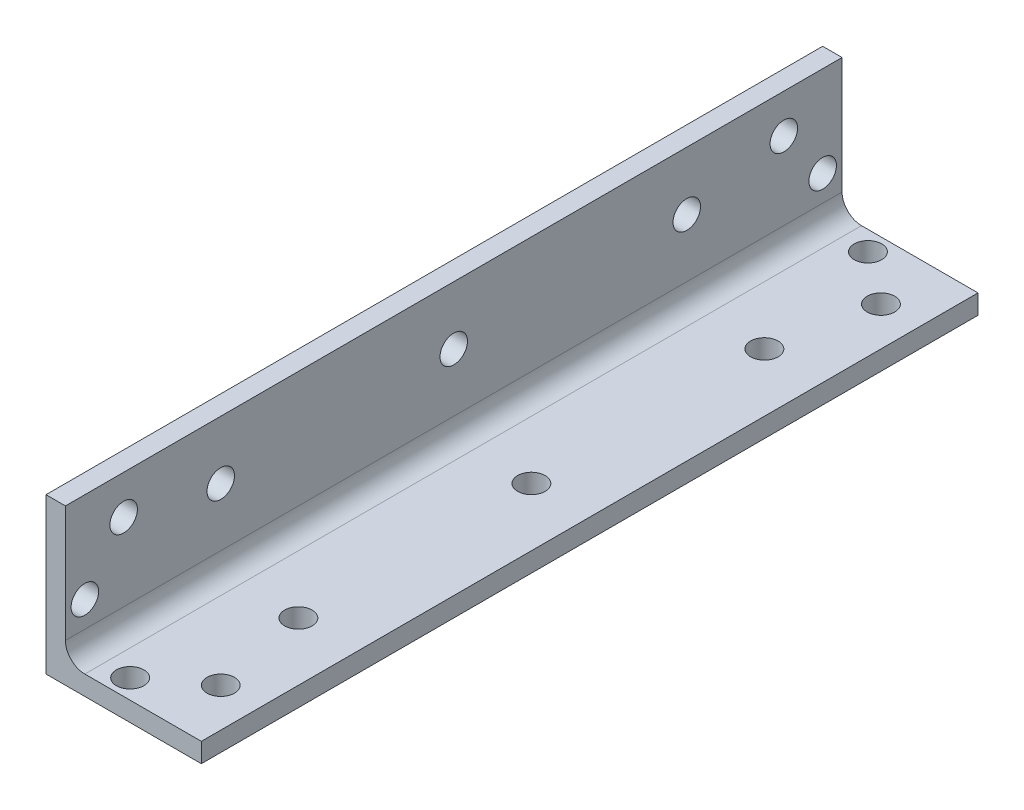
ISO-10303-21;
HEADER;
FILE_DESCRIPTION(('STEP AP214'),'2;1');
FILE_NAME('part.step','',(''),(''),'','','');
FILE_SCHEMA(('AUTOMOTIVE_DESIGN { 1 0 10303 214 1 1 1 1 }'));
ENDSEC;
DATA;
#1=APPLICATION_CONTEXT('core data for automotive mechanical design processes');
#2=APPLICATION_PROTOCOL_DEFINITION('international standard','automotive_design',2000,#1);
#3=PRODUCT_CONTEXT('',#1,'mechanical');
#4=PRODUCT('Part','Part','',(#3));
#5=PRODUCT_RELATED_PRODUCT_CATEGORY('part','',(#4));
#6=PRODUCT_DEFINITION_FORMATION('','',#4);
#7=PRODUCT_DEFINITION_CONTEXT('part definition',#1,'design');
#8=PRODUCT_DEFINITION('design','',#6,#7);
#9=PRODUCT_DEFINITION_SHAPE('','',#8);
#10=(LENGTH_UNIT() NAMED_UNIT(*) SI_UNIT(.MILLI.,.METRE.));
#11=(NAMED_UNIT(*) PLANE_ANGLE_UNIT() SI_UNIT($,.RADIAN.));
#12=(NAMED_UNIT(*) SI_UNIT($,.STERADIAN.) SOLID_ANGLE_UNIT());
#13=UNCERTAINTY_MEASURE_WITH_UNIT(LENGTH_MEASURE(1.E-05),#10,'distance_accuracy_value','');
#14=(GEOMETRIC_REPRESENTATION_CONTEXT(3) GLOBAL_UNCERTAINTY_ASSIGNED_CONTEXT((#13)) GLOBAL_UNIT_ASSIGNED_CONTEXT((#10,
#11,#12)) REPRESENTATION_CONTEXT('',''));
#15=CARTESIAN_POINT('',(0.,0.,0.));
#16=DIRECTION('',(0.,0.,1.));
#17=DIRECTION('',(1.,0.,0.));
#18=AXIS2_PLACEMENT_3D('',#15,#16,#17);
#19=CARTESIAN_POINT('',(3.175,25.4,63.5));
#20=DIRECTION('',(0.,-1.,0.));
#21=DIRECTION('',(0.,0.,-1.));
#22=AXIS2_PLACEMENT_3D('',#19,#20,#21);
#23=PLANE('',#22);
#24=DIRECTION('',(-1.,0.,0.));
#25=VECTOR('',#24,1.);
#26=CARTESIAN_POINT('',(3.175,25.4,-63.5));
#27=LINE('',#26,#25);
#28=CARTESIAN_POINT('',(3.175,25.4,-63.5));
#29=VERTEX_POINT('',#28);
#30=CARTESIAN_POINT('',(0.,25.4,-63.5));
#31=VERTEX_POINT('',#30);
#32=EDGE_CURVE('E129',#29,#31,#27,.T.);
#33=ORIENTED_EDGE('',*,*,#32,.T.);
#34=DIRECTION('',(0.,0.,-1.));
#35=VECTOR('',#34,1.);
#36=CARTESIAN_POINT('',(0.,25.4,63.5));
#37=LINE('',#36,#35);
#38=CARTESIAN_POINT('',(0.,25.4,63.5));
#39=VERTEX_POINT('',#38);
#40=EDGE_CURVE('E108',#39,#31,#37,.T.);
#41=ORIENTED_EDGE('',*,*,#40,.F.);
#42=DIRECTION('',(-1.,0.,0.));
#43=VECTOR('',#42,1.);
#44=CARTESIAN_POINT('',(3.175,25.4,63.5));
#45=LINE('',#44,#43);
#46=CARTESIAN_POINT('',(3.175,25.4,63.5));
#47=VERTEX_POINT('',#46);
#48=EDGE_CURVE('E116',#47,#39,#45,.T.);
#49=ORIENTED_EDGE('',*,*,#48,.F.);
#50=DIRECTION('',(0.,0.,-1.));
#51=VECTOR('',#50,1.);
#52=CARTESIAN_POINT('',(3.175,25.4,63.5));
#53=LINE('',#52,#51);
#54=EDGE_CURVE('E244',#47,#29,#53,.T.);
#55=ORIENTED_EDGE('',*,*,#54,.T.);
#56=EDGE_LOOP('',(#33,#41,#49,#55));
#57=FACE_BOUND('',#56,.T.);
#58=ADVANCED_FACE('F42',(#57),#23,.F.);
#59=CARTESIAN_POINT('',(0.,25.4,63.5));
#60=DIRECTION('',(1.,0.,0.));
#61=DIRECTION('',(0.,0.,-1.));
#62=AXIS2_PLACEMENT_3D('',#59,#60,#61);
#63=PLANE('',#62);
#64=CARTESIAN_POINT('',(0.,10.5833333333334,-60.3250000000002));
#65=DIRECTION('',(1.,0.,0.));
#66=DIRECTION('',(0.,0.,-1.));
#67=AXIS2_PLACEMENT_3D('',#64,#65,#66);
#68=CIRCLE('',#67,2.25);
#69=CARTESIAN_POINT('',(0.,10.5833333333334,-62.5750000000002));
#70=VERTEX_POINT('',#69);
#71=EDGE_CURVE('E547',#70,#70,#68,.T.);
#72=ORIENTED_EDGE('',*,*,#71,.T.);
#73=EDGE_LOOP('',(#72));
#74=FACE_BOUND('',#73,.T.);
#75=CARTESIAN_POINT('',(0.,10.5833333333334,60.3250000000002));
#76=DIRECTION('',(1.,0.,0.));
#77=DIRECTION('',(0.,0.,1.));
#78=AXIS2_PLACEMENT_3D('',#75,#76,#77);
#79=CIRCLE('',#78,2.25);
#80=CARTESIAN_POINT('',(0.,10.5833333333334,62.5750000000002));
#81=VERTEX_POINT('',#80);
#82=EDGE_CURVE('E549',#81,#81,#79,.T.);
#83=ORIENTED_EDGE('',*,*,#82,.T.);
#84=EDGE_LOOP('',(#83));
#85=FACE_BOUND('',#84,.T.);
#86=CARTESIAN_POINT('',(0.,19.0500000000001,53.9750000000002));
#87=DIRECTION('',(1.,0.,0.));
#88=DIRECTION('',(0.,0.,1.));
#89=AXIS2_PLACEMENT_3D('',#86,#87,#88);
#90=CIRCLE('',#89,2.25);
#91=CARTESIAN_POINT('',(0.,19.0500000000001,56.2250000000002));
#92=VERTEX_POINT('',#91);
#93=EDGE_CURVE('E555',#92,#92,#90,.T.);
#94=ORIENTED_EDGE('',*,*,#93,.T.);
#95=EDGE_LOOP('',(#94));
#96=FACE_BOUND('',#95,.T.);
#97=CARTESIAN_POINT('',(0.,15.87,38.0999999999997));
#98=DIRECTION('',(1.,0.,0.));
#99=DIRECTION('',(0.,0.,-1.));
#100=AXIS2_PLACEMENT_3D('',#97,#98,#99);
#101=CIRCLE('',#100,2.25);
#102=CARTESIAN_POINT('',(0.,15.87,35.8499999999997));
#103=VERTEX_POINT('',#102);
#104=EDGE_CURVE('E564',#103,#103,#101,.T.);
#105=ORIENTED_EDGE('',*,*,#104,.T.);
#106=EDGE_LOOP('',(#105));
#107=FACE_BOUND('',#106,.T.);
#108=CARTESIAN_POINT('',(0.,15.8700000000004,-2.63677968348475E-13));
#109=DIRECTION('',(1.,0.,0.));
#110=DIRECTION('',(0.,0.,-1.));
#111=AXIS2_PLACEMENT_3D('',#108,#109,#110);
#112=CIRCLE('',#111,2.25);
#113=CARTESIAN_POINT('',(0.,15.8700000000004,-2.25000000000026));
#114=VERTEX_POINT('',#113);
#115=EDGE_CURVE('E567',#114,#114,#112,.T.);
#116=ORIENTED_EDGE('',*,*,#115,.T.);
#117=EDGE_LOOP('',(#116));
#118=FACE_BOUND('',#117,.T.);
#119=CARTESIAN_POINT('',(0.,15.8700000000008,-38.1000000000003));
#120=DIRECTION('',(1.,0.,0.));
#121=DIRECTION('',(0.,0.,-1.));
#122=AXIS2_PLACEMENT_3D('',#119,#120,#121);
#123=CIRCLE('',#122,2.25);
#124=CARTESIAN_POINT('',(0.,15.8700000000008,-40.3500000000003));
#125=VERTEX_POINT('',#124);
#126=EDGE_CURVE('E558',#125,#125,#123,.T.);
#127=ORIENTED_EDGE('',*,*,#126,.T.);
#128=EDGE_LOOP('',(#127));
#129=FACE_BOUND('',#128,.T.);
#130=CARTESIAN_POINT('',(0.,19.0500000000001,-53.9750000000002));
#131=DIRECTION('',(1.,0.,0.));
#132=DIRECTION('',(0.,0.,-1.));
#133=AXIS2_PLACEMENT_3D('',#130,#131,#132);
#134=CIRCLE('',#133,2.25);
#135=CARTESIAN_POINT('',(0.,19.0500000000001,-56.2250000000002));
#136=VERTEX_POINT('',#135);
#137=EDGE_CURVE('E179',#136,#136,#134,.T.);
#138=ORIENTED_EDGE('',*,*,#137,.T.);
#139=EDGE_LOOP('',(#138));
#140=FACE_BOUND('',#139,.T.);
#141=DIRECTION('',(0.,-1.,0.));
#142=VECTOR('',#141,1.);
#143=CARTESIAN_POINT('',(0.,25.4,-63.5));
#144=LINE('',#143,#142);
#145=CARTESIAN_POINT('',(0.,0.,-63.5));
#146=VERTEX_POINT('',#145);
#147=EDGE_CURVE('E247',#31,#146,#144,.T.);
#148=ORIENTED_EDGE('',*,*,#147,.T.);
#149=DIRECTION('',(0.,0.,-1.));
#150=VECTOR('',#149,1.);
#151=CARTESIAN_POINT('',(0.,0.,63.5));
#152=LINE('',#151,#150);
#153=CARTESIAN_POINT('',(0.,0.,63.5));
#154=VERTEX_POINT('',#153);
#155=EDGE_CURVE('E111',#154,#146,#152,.T.);
#156=ORIENTED_EDGE('',*,*,#155,.F.);
#157=DIRECTION('',(0.,-1.,0.));
#158=VECTOR('',#157,1.);
#159=CARTESIAN_POINT('',(0.,25.4,63.5));
#160=LINE('',#159,#158);
#161=EDGE_CURVE('E104',#39,#154,#160,.T.);
#162=ORIENTED_EDGE('',*,*,#161,.F.);
#163=ORIENTED_EDGE('',*,*,#40,.T.);
#164=EDGE_LOOP('',(#148,#156,#162,#163));
#165=FACE_BOUND('',#164,.T.);
#166=ADVANCED_FACE('F106',(#74,#85,#96,#107,#118,#129,#140,#165),#63,.F.);
#167=CARTESIAN_POINT('',(0.,0.,63.5));
#168=DIRECTION('',(0.,1.,0.));
#169=DIRECTION('',(0.,0.,1.));
#170=AXIS2_PLACEMENT_3D('',#167,#168,#169);
#171=PLANE('',#170);
#172=CARTESIAN_POINT('',(10.5833333333334,0.,-60.3250000000002));
#173=DIRECTION('',(0.,-1.,0.));
#174=DIRECTION('',(0.,0.,-1.));
#175=AXIS2_PLACEMENT_3D('',#172,#173,#174);
#176=CIRCLE('',#175,2.25);
#177=CARTESIAN_POINT('',(10.5833333333334,0.,-62.5750000000002));
#178=VERTEX_POINT('',#177);
#179=EDGE_CURVE('E216',#178,#178,#176,.T.);
#180=ORIENTED_EDGE('',*,*,#179,.F.);
#181=EDGE_LOOP('',(#180));
#182=FACE_BOUND('',#181,.T.);
#183=CARTESIAN_POINT('',(10.5833333333334,0.,60.3250000000002));
#184=DIRECTION('',(0.,-1.,0.));
#185=DIRECTION('',(0.,0.,1.));
#186=AXIS2_PLACEMENT_3D('',#183,#184,#185);
#187=CIRCLE('',#186,2.25);
#188=CARTESIAN_POINT('',(10.5833333333334,0.,62.5750000000002));
#189=VERTEX_POINT('',#188);
#190=EDGE_CURVE('E220',#189,#189,#187,.T.);
#191=ORIENTED_EDGE('',*,*,#190,.F.);
#192=EDGE_LOOP('',(#191));
#193=FACE_BOUND('',#192,.T.);
#194=CARTESIAN_POINT('',(19.0500000000001,0.,53.9750000000002));
#195=DIRECTION('',(0.,-1.,0.));
#196=DIRECTION('',(0.,0.,1.));
#197=AXIS2_PLACEMENT_3D('',#194,#195,#196);
#198=CIRCLE('',#197,2.25);
#199=CARTESIAN_POINT('',(19.0500000000001,0.,56.2250000000002));
#200=VERTEX_POINT('',#199);
#201=EDGE_CURVE('E224',#200,#200,#198,.T.);
#202=ORIENTED_EDGE('',*,*,#201,.F.);
#203=EDGE_LOOP('',(#202));
#204=FACE_BOUND('',#203,.T.);
#205=CARTESIAN_POINT('',(15.87,0.,38.0999999999997));
#206=DIRECTION('',(0.,-1.,0.));
#207=DIRECTION('',(0.,0.,-1.));
#208=AXIS2_PLACEMENT_3D('',#205,#206,#207);
#209=CIRCLE('',#208,2.25);
#210=CARTESIAN_POINT('',(15.87,0.,35.8499999999997));
#211=VERTEX_POINT('',#210);
#212=EDGE_CURVE('E212',#211,#211,#209,.T.);
#213=ORIENTED_EDGE('',*,*,#212,.F.);
#214=EDGE_LOOP('',(#213));
#215=FACE_BOUND('',#214,.T.);
#216=CARTESIAN_POINT('',(15.8700000000004,0.,-2.63677968348475E-13));
#217=DIRECTION('',(0.,-1.,0.));
#218=DIRECTION('',(0.,0.,-1.));
#219=AXIS2_PLACEMENT_3D('',#216,#217,#218);
#220=CIRCLE('',#219,2.25);
#221=CARTESIAN_POINT('',(15.8700000000004,0.,-2.25000000000026));
#222=VERTEX_POINT('',#221);
#223=EDGE_CURVE('E206',#222,#222,#220,.T.);
#224=ORIENTED_EDGE('',*,*,#223,.F.);
#225=EDGE_LOOP('',(#224));
#226=FACE_BOUND('',#225,.T.);
#227=CARTESIAN_POINT('',(15.8700000000008,0.,-38.1000000000003));
#228=DIRECTION('',(0.,-1.,0.));
#229=DIRECTION('',(0.,0.,-1.));
#230=AXIS2_PLACEMENT_3D('',#227,#228,#229);
#231=CIRCLE('',#230,2.25);
#232=CARTESIAN_POINT('',(15.8700000000008,0.,-40.3500000000003));
#233=VERTEX_POINT('',#232);
#234=EDGE_CURVE('E201',#233,#233,#231,.T.);
#235=ORIENTED_EDGE('',*,*,#234,.F.);
#236=EDGE_LOOP('',(#235));
#237=FACE_BOUND('',#236,.T.);
#238=CARTESIAN_POINT('',(19.0500000000001,0.,-53.9750000000002));
#239=DIRECTION('',(0.,-1.,0.));
#240=DIRECTION('',(0.,0.,-1.));
#241=AXIS2_PLACEMENT_3D('',#238,#239,#240);
#242=CIRCLE('',#241,2.25);
#243=CARTESIAN_POINT('',(19.0500000000001,0.,-56.2250000000002));
#244=VERTEX_POINT('',#243);
#245=EDGE_CURVE('E150',#244,#244,#242,.T.);
#246=ORIENTED_EDGE('',*,*,#245,.F.);
#247=EDGE_LOOP('',(#246));
#248=FACE_BOUND('',#247,.T.);
#249=DIRECTION('',(1.,0.,0.));
#250=VECTOR('',#249,1.);
#251=CARTESIAN_POINT('',(0.,0.,-63.5));
#252=LINE('',#251,#250);
#253=CARTESIAN_POINT('',(25.4,0.,-63.5));
#254=VERTEX_POINT('',#253);
#255=EDGE_CURVE('E250',#146,#254,#252,.T.);
#256=ORIENTED_EDGE('',*,*,#255,.T.);
#257=DIRECTION('',(0.,0.,-1.));
#258=VECTOR('',#257,1.);
#259=CARTESIAN_POINT('',(25.4,0.,63.5));
#260=LINE('',#259,#258);
#261=CARTESIAN_POINT('',(25.4,0.,63.5));
#262=VERTEX_POINT('',#261);
#263=EDGE_CURVE('E137',#262,#254,#260,.T.);
#264=ORIENTED_EDGE('',*,*,#263,.F.);
#265=DIRECTION('',(1.,0.,0.));
#266=VECTOR('',#265,1.);
#267=CARTESIAN_POINT('',(0.,0.,63.5));
#268=LINE('',#267,#266);
#269=EDGE_CURVE('E115',#154,#262,#268,.T.);
#270=ORIENTED_EDGE('',*,*,#269,.F.);
#271=ORIENTED_EDGE('',*,*,#155,.T.);
#272=EDGE_LOOP('',(#256,#264,#270,#271));
#273=FACE_BOUND('',#272,.T.);
#274=ADVANCED_FACE('F283',(#182,#193,#204,#215,#226,#237,#248,#273),#171,.F.);
#275=CARTESIAN_POINT('',(25.4,0.,63.5));
#276=DIRECTION('',(-1.,0.,0.));
#277=DIRECTION('',(0.,0.,1.));
#278=AXIS2_PLACEMENT_3D('',#275,#276,#277);
#279=PLANE('',#278);
#280=DIRECTION('',(0.,1.,0.));
#281=VECTOR('',#280,1.);
#282=CARTESIAN_POINT('',(25.4,0.,-63.5));
#283=LINE('',#282,#281);
#284=CARTESIAN_POINT('',(25.4,3.175,-63.5));
#285=VERTEX_POINT('',#284);
#286=EDGE_CURVE('E253',#254,#285,#283,.T.);
#287=ORIENTED_EDGE('',*,*,#286,.T.);
#288=DIRECTION('',(0.,0.,-1.));
#289=VECTOR('',#288,1.);
#290=CARTESIAN_POINT('',(25.4,3.175,63.5));
#291=LINE('',#290,#289);
#292=CARTESIAN_POINT('',(25.4,3.175,63.5));
#293=VERTEX_POINT('',#292);
#294=EDGE_CURVE('E263',#293,#285,#291,.T.);
#295=ORIENTED_EDGE('',*,*,#294,.F.);
#296=DIRECTION('',(0.,1.,0.));
#297=VECTOR('',#296,1.);
#298=CARTESIAN_POINT('',(25.4,0.,63.5));
#299=LINE('',#298,#297);
#300=EDGE_CURVE('E236',#262,#293,#299,.T.);
#301=ORIENTED_EDGE('',*,*,#300,.F.);
#302=ORIENTED_EDGE('',*,*,#263,.T.);
#303=EDGE_LOOP('',(#287,#295,#301,#302));
#304=FACE_BOUND('',#303,.T.);
#305=ADVANCED_FACE('F272',(#304),#279,.F.);
#306=CARTESIAN_POINT('',(25.4,3.175,63.5));
#307=DIRECTION('',(0.,-1.,0.));
#308=DIRECTION('',(0.,0.,-1.));
#309=AXIS2_PLACEMENT_3D('',#306,#307,#308);
#310=PLANE('',#309);
#311=CARTESIAN_POINT('',(10.5833333333334,3.175,-60.3250000000002));
#312=DIRECTION('',(0.,-1.,0.));
#313=DIRECTION('',(0.,0.,-1.));
#314=AXIS2_PLACEMENT_3D('',#311,#312,#313);
#315=CIRCLE('',#314,2.25);
#316=CARTESIAN_POINT('',(10.5833333333334,3.175,-62.5750000000002));
#317=VERTEX_POINT('',#316);
#318=EDGE_CURVE('E170',#317,#317,#315,.T.);
#319=ORIENTED_EDGE('',*,*,#318,.T.);
#320=EDGE_LOOP('',(#319));
#321=FACE_BOUND('',#320,.T.);
#322=CARTESIAN_POINT('',(10.5833333333334,3.175,60.3250000000002));
#323=DIRECTION('',(0.,-1.,0.));
#324=DIRECTION('',(0.,0.,-1.));
#325=AXIS2_PLACEMENT_3D('',#322,#323,#324);
#326=CIRCLE('',#325,2.25);
#327=CARTESIAN_POINT('',(10.5833333333334,3.175,58.0750000000002));
#328=VERTEX_POINT('',#327);
#329=EDGE_CURVE('E166',#328,#328,#326,.T.);
#330=ORIENTED_EDGE('',*,*,#329,.T.);
#331=EDGE_LOOP('',(#330));
#332=FACE_BOUND('',#331,.T.);
#333=CARTESIAN_POINT('',(19.0500000000001,3.175,53.9750000000002));
#334=DIRECTION('',(0.,-1.,0.));
#335=DIRECTION('',(0.,0.,-1.));
#336=AXIS2_PLACEMENT_3D('',#333,#334,#335);
#337=CIRCLE('',#336,2.25);
#338=CARTESIAN_POINT('',(19.0500000000001,3.175,51.7250000000002));
#339=VERTEX_POINT('',#338);
#340=EDGE_CURVE('E162',#339,#339,#337,.T.);
#341=ORIENTED_EDGE('',*,*,#340,.T.);
#342=EDGE_LOOP('',(#341));
#343=FACE_BOUND('',#342,.T.);
#344=CARTESIAN_POINT('',(15.87,3.175,38.0999999999997));
#345=DIRECTION('',(0.,-1.,0.));
#346=DIRECTION('',(0.,0.,-1.));
#347=AXIS2_PLACEMENT_3D('',#344,#345,#346);
#348=CIRCLE('',#347,2.25);
#349=CARTESIAN_POINT('',(15.87,3.175,35.8499999999997));
#350=VERTEX_POINT('',#349);
#351=EDGE_CURVE('E158',#350,#350,#348,.T.);
#352=ORIENTED_EDGE('',*,*,#351,.T.);
#353=EDGE_LOOP('',(#352));
#354=FACE_BOUND('',#353,.T.);
#355=CARTESIAN_POINT('',(15.8700000000004,3.175,-2.63677968348475E-13));
#356=DIRECTION('',(0.,-1.,0.));
#357=DIRECTION('',(0.,0.,-1.));
#358=AXIS2_PLACEMENT_3D('',#355,#356,#357);
#359=CIRCLE('',#358,2.25);
#360=CARTESIAN_POINT('',(15.8700000000004,3.175,-2.25000000000026));
#361=VERTEX_POINT('',#360);
#362=EDGE_CURVE('E154',#361,#361,#359,.T.);
#363=ORIENTED_EDGE('',*,*,#362,.T.);
#364=EDGE_LOOP('',(#363));
#365=FACE_BOUND('',#364,.T.);
#366=CARTESIAN_POINT('',(15.8700000000008,3.175,-38.1000000000003));
#367=DIRECTION('',(0.,-1.,0.));
#368=DIRECTION('',(0.,0.,-1.));
#369=AXIS2_PLACEMENT_3D('',#366,#367,#368);
#370=CIRCLE('',#369,2.25);
#371=CARTESIAN_POINT('',(15.8700000000008,3.175,-40.3500000000003));
#372=VERTEX_POINT('',#371);
#373=EDGE_CURVE('E149',#372,#372,#370,.T.);
#374=ORIENTED_EDGE('',*,*,#373,.T.);
#375=EDGE_LOOP('',(#374));
#376=FACE_BOUND('',#375,.T.);
#377=CARTESIAN_POINT('',(19.0500000000001,3.175,-53.9750000000002));
#378=DIRECTION('',(0.,-1.,0.));
#379=DIRECTION('',(0.,0.,-1.));
#380=AXIS2_PLACEMENT_3D('',#377,#378,#379);
#381=CIRCLE('',#380,2.25);
#382=CARTESIAN_POINT('',(19.0500000000001,3.175,-56.2250000000002));
#383=VERTEX_POINT('',#382);
#384=EDGE_CURVE('E145',#383,#383,#381,.T.);
#385=ORIENTED_EDGE('',*,*,#384,.T.);
#386=EDGE_LOOP('',(#385));
#387=FACE_BOUND('',#386,.T.);
#388=DIRECTION('',(-1.,0.,0.));
#389=VECTOR('',#388,1.);
#390=CARTESIAN_POINT('',(25.4,3.175,-63.5));
#391=LINE('',#390,#389);
#392=CARTESIAN_POINT('',(6.35,3.175,-63.5));
#393=VERTEX_POINT('',#392);
#394=EDGE_CURVE('E256',#285,#393,#391,.T.);
#395=ORIENTED_EDGE('',*,*,#394,.T.);
#396=DIRECTION('',(0.,0.,-1.));
#397=VECTOR('',#396,1.);
#398=CARTESIAN_POINT('',(6.35,3.175,63.5));
#399=LINE('',#398,#397);
#400=CARTESIAN_POINT('',(6.35,3.175,63.5));
#401=VERTEX_POINT('',#400);
#402=EDGE_CURVE('E60',#393,#401,#399,.F.);
#403=ORIENTED_EDGE('',*,*,#402,.T.);
#404=DIRECTION('',(-1.,0.,0.));
#405=VECTOR('',#404,1.);
#406=CARTESIAN_POINT('',(25.4,3.175,63.5));
#407=LINE('',#406,#405);
#408=EDGE_CURVE('E239',#293,#401,#407,.T.);
#409=ORIENTED_EDGE('',*,*,#408,.F.);
#410=ORIENTED_EDGE('',*,*,#294,.T.);
#411=EDGE_LOOP('',(#395,#403,#409,#410));
#412=FACE_BOUND('',#411,.T.);
#413=ADVANCED_FACE('F277',(#321,#332,#343,#354,#365,#376,#387,#412),#310,.F.);
#414=CARTESIAN_POINT('',(3.175,3.175,63.5));
#415=DIRECTION('',(-1.,0.,0.));
#416=DIRECTION('',(0.,0.,1.));
#417=AXIS2_PLACEMENT_3D('',#414,#415,#416);
#418=PLANE('',#417);
#419=CARTESIAN_POINT('',(3.175,10.5833333333334,-60.3250000000002));
#420=DIRECTION('',(-1.,0.,0.));
#421=DIRECTION('',(0.,0.,1.));
#422=AXIS2_PLACEMENT_3D('',#419,#420,#421);
#423=CIRCLE('',#422,2.25);
#424=CARTESIAN_POINT('',(3.175,10.5833333333334,-58.0750000000002));
#425=VERTEX_POINT('',#424);
#426=EDGE_CURVE('E46',#425,#425,#423,.F.);
#427=ORIENTED_EDGE('',*,*,#426,.F.);
#428=EDGE_LOOP('',(#427));
#429=FACE_BOUND('',#428,.T.);
#430=CARTESIAN_POINT('',(3.175,10.5833333333334,60.3250000000002));
#431=DIRECTION('',(-1.,0.,0.));
#432=DIRECTION('',(0.,0.,1.));
#433=AXIS2_PLACEMENT_3D('',#430,#431,#432);
#434=CIRCLE('',#433,2.25);
#435=CARTESIAN_POINT('',(3.175,10.5833333333334,62.5750000000002));
#436=VERTEX_POINT('',#435);
#437=EDGE_CURVE('E194',#436,#436,#434,.F.);
#438=ORIENTED_EDGE('',*,*,#437,.F.);
#439=EDGE_LOOP('',(#438));
#440=FACE_BOUND('',#439,.T.);
#441=CARTESIAN_POINT('',(3.175,19.0500000000001,53.9750000000002));
#442=DIRECTION('',(-1.,0.,0.));
#443=DIRECTION('',(0.,0.,1.));
#444=AXIS2_PLACEMENT_3D('',#441,#442,#443);
#445=CIRCLE('',#444,2.25);
#446=CARTESIAN_POINT('',(3.175,19.0500000000001,56.2250000000002));
#447=VERTEX_POINT('',#446);
#448=EDGE_CURVE('E191',#447,#447,#445,.F.);
#449=ORIENTED_EDGE('',*,*,#448,.F.);
#450=EDGE_LOOP('',(#449));
#451=FACE_BOUND('',#450,.T.);
#452=CARTESIAN_POINT('',(3.175,15.87,38.0999999999997));
#453=DIRECTION('',(-1.,0.,0.));
#454=DIRECTION('',(0.,0.,1.));
#455=AXIS2_PLACEMENT_3D('',#452,#453,#454);
#456=CIRCLE('',#455,2.25);
#457=CARTESIAN_POINT('',(3.175,15.87,40.3499999999997));
#458=VERTEX_POINT('',#457);
#459=EDGE_CURVE('E187',#458,#458,#456,.F.);
#460=ORIENTED_EDGE('',*,*,#459,.F.);
#461=EDGE_LOOP('',(#460));
#462=FACE_BOUND('',#461,.T.);
#463=CARTESIAN_POINT('',(3.175,15.8700000000004,-2.63677968348475E-13));
#464=DIRECTION('',(-1.,0.,0.));
#465=DIRECTION('',(0.,0.,1.));
#466=AXIS2_PLACEMENT_3D('',#463,#464,#465);
#467=CIRCLE('',#466,2.25);
#468=CARTESIAN_POINT('',(3.175,15.8700000000004,2.24999999999974));
#469=VERTEX_POINT('',#468);
#470=EDGE_CURVE('E183',#469,#469,#467,.F.);
#471=ORIENTED_EDGE('',*,*,#470,.F.);
#472=EDGE_LOOP('',(#471));
#473=FACE_BOUND('',#472,.T.);
#474=CARTESIAN_POINT('',(3.175,15.8700000000008,-38.1000000000003));
#475=DIRECTION('',(-1.,0.,0.));
#476=DIRECTION('',(0.,0.,1.));
#477=AXIS2_PLACEMENT_3D('',#474,#475,#476);
#478=CIRCLE('',#477,2.25);
#479=CARTESIAN_POINT('',(3.175,15.8700000000008,-35.8500000000003));
#480=VERTEX_POINT('',#479);
#481=EDGE_CURVE('E178',#480,#480,#478,.F.);
#482=ORIENTED_EDGE('',*,*,#481,.F.);
#483=EDGE_LOOP('',(#482));
#484=FACE_BOUND('',#483,.T.);
#485=CARTESIAN_POINT('',(3.175,19.0500000000001,-53.9750000000002));
#486=DIRECTION('',(-1.,0.,0.));
#487=DIRECTION('',(0.,0.,1.));
#488=AXIS2_PLACEMENT_3D('',#485,#486,#487);
#489=CIRCLE('',#488,2.25);
#490=CARTESIAN_POINT('',(3.175,19.0500000000001,-51.7250000000002));
#491=VERTEX_POINT('',#490);
#492=EDGE_CURVE('E174',#491,#491,#489,.F.);
#493=ORIENTED_EDGE('',*,*,#492,.F.);
#494=EDGE_LOOP('',(#493));
#495=FACE_BOUND('',#494,.T.);
#496=DIRECTION('',(0.,1.,0.));
#497=VECTOR('',#496,1.);
#498=CARTESIAN_POINT('',(3.175,3.175,63.5));
#499=LINE('',#498,#497);
#500=CARTESIAN_POINT('',(3.175,6.35,63.5));
#501=VERTEX_POINT('',#500);
#502=EDGE_CURVE('E121',#501,#47,#499,.T.);
#503=ORIENTED_EDGE('',*,*,#502,.F.);
#504=DIRECTION('',(0.,0.,-1.));
#505=VECTOR('',#504,1.);
#506=CARTESIAN_POINT('',(3.175,6.35,-63.5));
#507=LINE('',#506,#505);
#508=CARTESIAN_POINT('',(3.175,6.35,-63.5));
#509=VERTEX_POINT('',#508);
#510=EDGE_CURVE('E131',#501,#509,#507,.T.);
#511=ORIENTED_EDGE('',*,*,#510,.T.);
#512=DIRECTION('',(0.,1.,0.));
#513=VECTOR('',#512,1.);
#514=CARTESIAN_POINT('',(3.175,3.175,-63.5));
#515=LINE('',#514,#513);
#516=EDGE_CURVE('E126',#509,#29,#515,.T.);
#517=ORIENTED_EDGE('',*,*,#516,.T.);
#518=ORIENTED_EDGE('',*,*,#54,.F.);
#519=EDGE_LOOP('',(#503,#511,#517,#518));
#520=FACE_BOUND('',#519,.T.);
#521=ADVANCED_FACE('F282',(#429,#440,#451,#462,#473,#484,#495,#520),#418,.F.);
#522=CARTESIAN_POINT('',(0.,0.,63.5));
#523=DIRECTION('',(0.,0.,1.));
#524=DIRECTION('',(1.,0.,0.));
#525=AXIS2_PLACEMENT_3D('',#522,#523,#524);
#526=PLANE('',#525);
#527=ORIENTED_EDGE('',*,*,#48,.T.);
#528=ORIENTED_EDGE('',*,*,#161,.T.);
#529=ORIENTED_EDGE('',*,*,#269,.T.);
#530=ORIENTED_EDGE('',*,*,#300,.T.);
#531=ORIENTED_EDGE('',*,*,#408,.T.);
#532=CARTESIAN_POINT('',(6.35,6.35,63.5));
#533=DIRECTION('',(0.,0.,1.));
#534=DIRECTION('',(1.,0.,0.));
#535=AXIS2_PLACEMENT_3D('',#532,#533,#534);
#536=CIRCLE('',#535,3.175);
#537=EDGE_CURVE('E11',#401,#501,#536,.F.);
#538=ORIENTED_EDGE('',*,*,#537,.T.);
#539=ORIENTED_EDGE('',*,*,#502,.T.);
#540=EDGE_LOOP('',(#527,#528,#529,#530,#531,#538,#539));
#541=FACE_BOUND('',#540,.T.);
#542=ADVANCED_FACE('F119',(#541),#526,.T.);
#543=CARTESIAN_POINT('',(0.,0.,-63.5));
#544=DIRECTION('',(0.,0.,1.));
#545=DIRECTION('',(1.,0.,0.));
#546=AXIS2_PLACEMENT_3D('',#543,#544,#545);
#547=PLANE('',#546);
#548=ORIENTED_EDGE('',*,*,#32,.F.);
#549=ORIENTED_EDGE('',*,*,#516,.F.);
#550=CARTESIAN_POINT('',(6.35,6.35,-63.5));
#551=DIRECTION('',(0.,0.,1.));
#552=DIRECTION('',(1.,0.,0.));
#553=AXIS2_PLACEMENT_3D('',#550,#551,#552);
#554=CIRCLE('',#553,3.175);
#555=EDGE_CURVE('E52',#509,#393,#554,.T.);
#556=ORIENTED_EDGE('',*,*,#555,.T.);
#557=ORIENTED_EDGE('',*,*,#394,.F.);
#558=ORIENTED_EDGE('',*,*,#286,.F.);
#559=ORIENTED_EDGE('',*,*,#255,.F.);
#560=ORIENTED_EDGE('',*,*,#147,.F.);
#561=EDGE_LOOP('',(#548,#549,#556,#557,#558,#559,#560));
#562=FACE_BOUND('',#561,.T.);
#563=ADVANCED_FACE('F276',(#562),#547,.F.);
#564=CARTESIAN_POINT('',(6.35,6.35,63.5));
#565=DIRECTION('',(0.,0.,1.));
#566=DIRECTION('',(1.,0.,0.));
#567=AXIS2_PLACEMENT_3D('',#564,#565,#566);
#568=CYLINDRICAL_SURFACE('',#567,3.175);
#569=ORIENTED_EDGE('',*,*,#537,.F.);
#570=ORIENTED_EDGE('',*,*,#402,.F.);
#571=ORIENTED_EDGE('',*,*,#555,.F.);
#572=ORIENTED_EDGE('',*,*,#510,.F.);
#573=EDGE_LOOP('',(#569,#570,#571,#572));
#574=FACE_BOUND('',#573,.T.);
#575=ADVANCED_FACE('F44',(#574),#568,.F.);
#576=CARTESIAN_POINT('',(19.0500000000001,25.4,-53.9750000000002));
#577=DIRECTION('',(0.,-1.,0.));
#578=DIRECTION('',(0.,0.,-1.));
#579=AXIS2_PLACEMENT_3D('',#576,#577,#578);
#580=CYLINDRICAL_SURFACE('',#579,2.25);
#581=ORIENTED_EDGE('',*,*,#245,.T.);
#582=EDGE_LOOP('',(#581));
#583=FACE_BOUND('',#582,.T.);
#584=ORIENTED_EDGE('',*,*,#384,.F.);
#585=EDGE_LOOP('',(#584));
#586=FACE_BOUND('',#585,.T.);
#587=ADVANCED_FACE('F363',(#583,#586),#580,.F.);
#588=CARTESIAN_POINT('',(15.8700000000008,25.4,-38.1000000000003));
#589=DIRECTION('',(0.,-1.,0.));
#590=DIRECTION('',(0.,0.,-1.));
#591=AXIS2_PLACEMENT_3D('',#588,#589,#590);
#592=CYLINDRICAL_SURFACE('',#591,2.25);
#593=ORIENTED_EDGE('',*,*,#234,.T.);
#594=EDGE_LOOP('',(#593));
#595=FACE_BOUND('',#594,.T.);
#596=ORIENTED_EDGE('',*,*,#373,.F.);
#597=EDGE_LOOP('',(#596));
#598=FACE_BOUND('',#597,.T.);
#599=ADVANCED_FACE('F367',(#595,#598),#592,.F.);
#600=CARTESIAN_POINT('',(15.8700000000004,25.4,-2.63677968348475E-13));
#601=DIRECTION('',(0.,-1.,0.));
#602=DIRECTION('',(0.,0.,-1.));
#603=AXIS2_PLACEMENT_3D('',#600,#601,#602);
#604=CYLINDRICAL_SURFACE('',#603,2.25);
#605=ORIENTED_EDGE('',*,*,#223,.T.);
#606=EDGE_LOOP('',(#605));
#607=FACE_BOUND('',#606,.T.);
#608=ORIENTED_EDGE('',*,*,#362,.F.);
#609=EDGE_LOOP('',(#608));
#610=FACE_BOUND('',#609,.T.);
#611=ADVANCED_FACE('F375',(#607,#610),#604,.F.);
#612=CARTESIAN_POINT('',(15.87,25.4,38.0999999999997));
#613=DIRECTION('',(0.,-1.,0.));
#614=DIRECTION('',(0.,0.,-1.));
#615=AXIS2_PLACEMENT_3D('',#612,#613,#614);
#616=CYLINDRICAL_SURFACE('',#615,2.25);
#617=ORIENTED_EDGE('',*,*,#212,.T.);
#618=EDGE_LOOP('',(#617));
#619=FACE_BOUND('',#618,.T.);
#620=ORIENTED_EDGE('',*,*,#351,.F.);
#621=EDGE_LOOP('',(#620));
#622=FACE_BOUND('',#621,.T.);
#623=ADVANCED_FACE('F382',(#619,#622),#616,.F.);
#624=CARTESIAN_POINT('',(19.0500000000001,25.4,53.9750000000002));
#625=DIRECTION('',(0.,-1.,0.));
#626=DIRECTION('',(0.,0.,-1.));
#627=AXIS2_PLACEMENT_3D('',#624,#625,#626);
#628=CYLINDRICAL_SURFACE('',#627,2.25);
#629=ORIENTED_EDGE('',*,*,#201,.T.);
#630=EDGE_LOOP('',(#629));
#631=FACE_BOUND('',#630,.T.);
#632=ORIENTED_EDGE('',*,*,#340,.F.);
#633=EDGE_LOOP('',(#632));
#634=FACE_BOUND('',#633,.T.);
#635=ADVANCED_FACE('F390',(#631,#634),#628,.F.);
#636=CARTESIAN_POINT('',(10.5833333333334,25.4,60.3250000000002));
#637=DIRECTION('',(0.,-1.,0.));
#638=DIRECTION('',(0.,0.,-1.));
#639=AXIS2_PLACEMENT_3D('',#636,#637,#638);
#640=CYLINDRICAL_SURFACE('',#639,2.25);
#641=ORIENTED_EDGE('',*,*,#190,.T.);
#642=EDGE_LOOP('',(#641));
#643=FACE_BOUND('',#642,.T.);
#644=ORIENTED_EDGE('',*,*,#329,.F.);
#645=EDGE_LOOP('',(#644));
#646=FACE_BOUND('',#645,.T.);
#647=ADVANCED_FACE('F398',(#643,#646),#640,.F.);
#648=CARTESIAN_POINT('',(10.5833333333334,25.4,-60.3250000000002));
#649=DIRECTION('',(0.,-1.,0.));
#650=DIRECTION('',(0.,0.,-1.));
#651=AXIS2_PLACEMENT_3D('',#648,#649,#650);
#652=CYLINDRICAL_SURFACE('',#651,2.25);
#653=ORIENTED_EDGE('',*,*,#179,.T.);
#654=EDGE_LOOP('',(#653));
#655=FACE_BOUND('',#654,.T.);
#656=ORIENTED_EDGE('',*,*,#318,.F.);
#657=EDGE_LOOP('',(#656));
#658=FACE_BOUND('',#657,.T.);
#659=ADVANCED_FACE('F406',(#655,#658),#652,.F.);
#660=CARTESIAN_POINT('',(25.4000000000001,19.05,-53.9750000000002));
#661=DIRECTION('',(-1.,0.,0.));
#662=DIRECTION('',(0.,-1.,0.));
#663=AXIS2_PLACEMENT_3D('',#660,#661,#662);
#664=CYLINDRICAL_SURFACE('',#663,2.25);
#665=ORIENTED_EDGE('',*,*,#137,.F.);
#666=EDGE_LOOP('',(#665));
#667=FACE_BOUND('',#666,.T.);
#668=ORIENTED_EDGE('',*,*,#492,.T.);
#669=EDGE_LOOP('',(#668));
#670=FACE_BOUND('',#669,.T.);
#671=ADVANCED_FACE('F413',(#667,#670),#664,.F.);
#672=CARTESIAN_POINT('',(25.4000000000001,15.8700000000007,-38.1000000000003));
#673=DIRECTION('',(-1.,0.,0.));
#674=DIRECTION('',(0.,-1.,0.));
#675=AXIS2_PLACEMENT_3D('',#672,#673,#674);
#676=CYLINDRICAL_SURFACE('',#675,2.25);
#677=ORIENTED_EDGE('',*,*,#126,.F.);
#678=EDGE_LOOP('',(#677));
#679=FACE_BOUND('',#678,.T.);
#680=ORIENTED_EDGE('',*,*,#481,.T.);
#681=EDGE_LOOP('',(#680));
#682=FACE_BOUND('',#681,.T.);
#683=ADVANCED_FACE('F420',(#679,#682),#676,.F.);
#684=CARTESIAN_POINT('',(25.4000000000001,15.8700000000003,-2.63677968348475E-13));
#685=DIRECTION('',(-1.,0.,0.));
#686=DIRECTION('',(0.,-1.,0.));
#687=AXIS2_PLACEMENT_3D('',#684,#685,#686);
#688=CYLINDRICAL_SURFACE('',#687,2.25);
#689=ORIENTED_EDGE('',*,*,#115,.F.);
#690=EDGE_LOOP('',(#689));
#691=FACE_BOUND('',#690,.T.);
#692=ORIENTED_EDGE('',*,*,#470,.T.);
#693=EDGE_LOOP('',(#692));
#694=FACE_BOUND('',#693,.T.);
#695=ADVANCED_FACE('F428',(#691,#694),#688,.F.);
#696=CARTESIAN_POINT('',(25.4000000000001,15.8699999999999,38.0999999999997));
#697=DIRECTION('',(-1.,0.,0.));
#698=DIRECTION('',(0.,-1.,0.));
#699=AXIS2_PLACEMENT_3D('',#696,#697,#698);
#700=CYLINDRICAL_SURFACE('',#699,2.25);
#701=ORIENTED_EDGE('',*,*,#104,.F.);
#702=EDGE_LOOP('',(#701));
#703=FACE_BOUND('',#702,.T.);
#704=ORIENTED_EDGE('',*,*,#459,.T.);
#705=EDGE_LOOP('',(#704));
#706=FACE_BOUND('',#705,.T.);
#707=ADVANCED_FACE('F436',(#703,#706),#700,.F.);
#708=CARTESIAN_POINT('',(25.4000000000001,19.05,53.9750000000002));
#709=DIRECTION('',(-1.,0.,0.));
#710=DIRECTION('',(0.,-1.,0.));
#711=AXIS2_PLACEMENT_3D('',#708,#709,#710);
#712=CYLINDRICAL_SURFACE('',#711,2.25);
#713=ORIENTED_EDGE('',*,*,#93,.F.);
#714=EDGE_LOOP('',(#713));
#715=FACE_BOUND('',#714,.T.);
#716=ORIENTED_EDGE('',*,*,#448,.T.);
#717=EDGE_LOOP('',(#716));
#718=FACE_BOUND('',#717,.T.);
#719=ADVANCED_FACE('F444',(#715,#718),#712,.F.);
#720=CARTESIAN_POINT('',(25.4,10.5833333333333,60.3250000000002));
#721=DIRECTION('',(-1.,0.,0.));
#722=DIRECTION('',(0.,-1.,0.));
#723=AXIS2_PLACEMENT_3D('',#720,#721,#722);
#724=CYLINDRICAL_SURFACE('',#723,2.25);
#725=ORIENTED_EDGE('',*,*,#82,.F.);
#726=EDGE_LOOP('',(#725));
#727=FACE_BOUND('',#726,.T.);
#728=ORIENTED_EDGE('',*,*,#437,.T.);
#729=EDGE_LOOP('',(#728));
#730=FACE_BOUND('',#729,.T.);
#731=ADVANCED_FACE('F452',(#727,#730),#724,.F.);
#732=CARTESIAN_POINT('',(25.4,10.5833333333333,-60.3250000000002));
#733=DIRECTION('',(-1.,0.,0.));
#734=DIRECTION('',(0.,-1.,0.));
#735=AXIS2_PLACEMENT_3D('',#732,#733,#734);
#736=CYLINDRICAL_SURFACE('',#735,2.25);
#737=ORIENTED_EDGE('',*,*,#71,.F.);
#738=EDGE_LOOP('',(#737));
#739=FACE_BOUND('',#738,.T.);
#740=ORIENTED_EDGE('',*,*,#426,.T.);
#741=EDGE_LOOP('',(#740));
#742=FACE_BOUND('',#741,.T.);
#743=ADVANCED_FACE('F460',(#739,#742),#736,.F.);
#744=CLOSED_SHELL('',(#58,#166,#274,#305,#413,#521,#542,#563,#575,#587,#599,#611,#623,#635,#647,
#659,#671,#683,#695,#707,#719,#731,#743));
#745=MANIFOLD_SOLID_BREP('B2',#744);
#746=ADVANCED_BREP_SHAPE_REPRESENTATION('',(#18,#745),#14);
#747=SHAPE_DEFINITION_REPRESENTATION(#9,#746);
ENDSEC;
END-ISO-10303-21;
